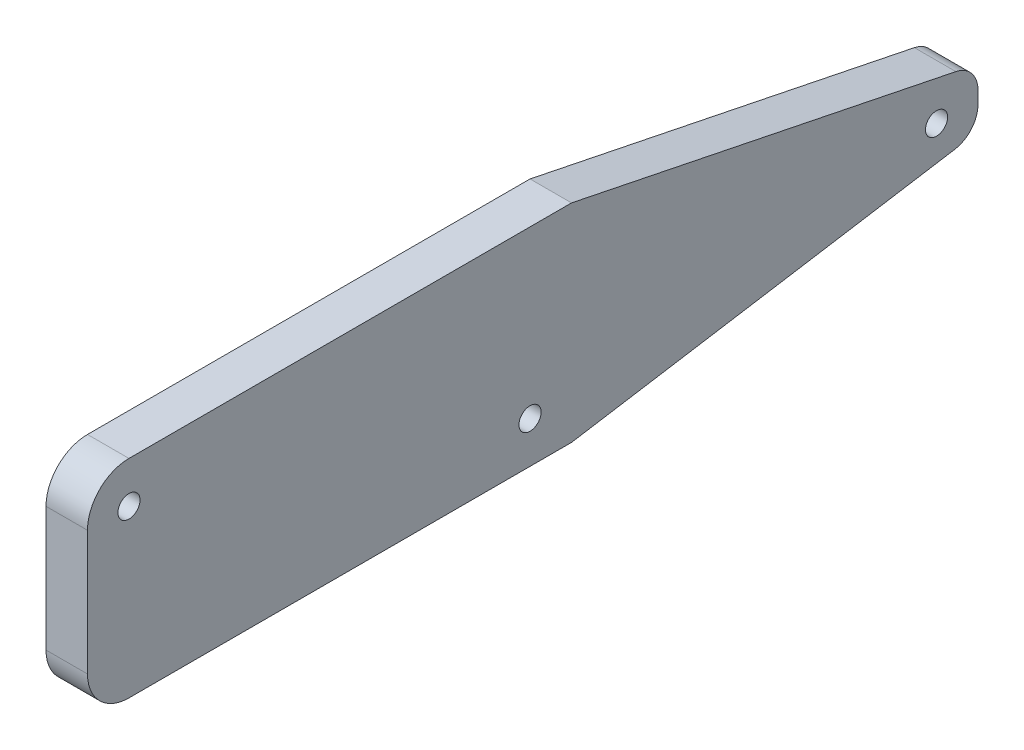
ISO-10303-21;
HEADER;
FILE_DESCRIPTION(('STEP AP214'),'2;1');
FILE_NAME('part.step','',(''),(''),'','','');
FILE_SCHEMA(('AUTOMOTIVE_DESIGN { 1 0 10303 214 1 1 1 1 }'));
ENDSEC;
DATA;
#1=APPLICATION_CONTEXT('core data for automotive mechanical design processes');
#2=APPLICATION_PROTOCOL_DEFINITION('international standard','automotive_design',2000,#1);
#3=PRODUCT_CONTEXT('',#1,'mechanical');
#4=PRODUCT('Part','Part','',(#3));
#5=PRODUCT_RELATED_PRODUCT_CATEGORY('part','',(#4));
#6=PRODUCT_DEFINITION_FORMATION('','',#4);
#7=PRODUCT_DEFINITION_CONTEXT('part definition',#1,'design');
#8=PRODUCT_DEFINITION('design','',#6,#7);
#9=PRODUCT_DEFINITION_SHAPE('','',#8);
#10=(LENGTH_UNIT() NAMED_UNIT(*) SI_UNIT(.MILLI.,.METRE.));
#11=(NAMED_UNIT(*) PLANE_ANGLE_UNIT() SI_UNIT($,.RADIAN.));
#12=(NAMED_UNIT(*) SI_UNIT($,.STERADIAN.) SOLID_ANGLE_UNIT());
#13=UNCERTAINTY_MEASURE_WITH_UNIT(LENGTH_MEASURE(1.E-05),#10,'distance_accuracy_value','');
#14=(GEOMETRIC_REPRESENTATION_CONTEXT(3) GLOBAL_UNCERTAINTY_ASSIGNED_CONTEXT((#13)) GLOBAL_UNIT_ASSIGNED_CONTEXT((#10,
#11,#12)) REPRESENTATION_CONTEXT('',''));
#15=CARTESIAN_POINT('',(0.,0.,0.));
#16=DIRECTION('',(0.,0.,1.));
#17=DIRECTION('',(1.,0.,0.));
#18=AXIS2_PLACEMENT_3D('',#15,#16,#17);
#19=CARTESIAN_POINT('',(3.,-0.13299316185545,-36.0759993740593));
#20=DIRECTION('',(1.,0.,0.));
#21=DIRECTION('',(0.,0.,-1.));
#22=AXIS2_PLACEMENT_3D('',#19,#20,#21);
#23=PLANE('',#22);
#24=CARTESIAN_POINT('',(3.,-4.49999999999999,-5.68212246066111));
#25=DIRECTION('',(1.,0.,0.));
#26=DIRECTION('',(0.,0.,-1.));
#27=AXIS2_PLACEMENT_3D('',#24,#25,#26);
#28=CIRCLE('',#27,0.8);
#29=CARTESIAN_POINT('',(3.,-4.49999999999999,-6.48212246066111));
#30=VERTEX_POINT('',#29);
#31=EDGE_CURVE('E341',#30,#30,#28,.T.);
#32=ORIENTED_EDGE('',*,*,#31,.F.);
#33=EDGE_LOOP('',(#32));
#34=FACE_BOUND('',#33,.T.);
#35=DIRECTION('',(0.,0.,1.));
#36=VECTOR('',#35,1.);
#37=CARTESIAN_POINT('',(3.,7.5,26.3178775393389));
#38=LINE('',#37,#36);
#39=CARTESIAN_POINT('',(3.,7.5,-8.68212246066111));
#40=VERTEX_POINT('',#39);
#41=CARTESIAN_POINT('',(3.,7.5,23.3178775393389));
#42=VERTEX_POINT('',#41);
#43=EDGE_CURVE('E148',#40,#42,#38,.T.);
#44=ORIENTED_EDGE('',*,*,#43,.T.);
#45=CARTESIAN_POINT('',(3.,4.5,23.3178775393389));
#46=DIRECTION('',(1.,0.,0.));
#47=DIRECTION('',(0.,0.,-1.));
#48=AXIS2_PLACEMENT_3D('',#45,#46,#47);
#49=CIRCLE('',#48,3.);
#50=CARTESIAN_POINT('',(3.,4.5,26.3178775393389));
#51=VERTEX_POINT('',#50);
#52=EDGE_CURVE('E11',#42,#51,#49,.T.);
#53=ORIENTED_EDGE('',*,*,#52,.T.);
#54=DIRECTION('',(0.,-1.,0.));
#55=VECTOR('',#54,1.);
#56=CARTESIAN_POINT('',(3.,-7.5,26.3178775393389));
#57=LINE('',#56,#55);
#58=CARTESIAN_POINT('',(3.,-4.5,26.3178775393389));
#59=VERTEX_POINT('',#58);
#60=EDGE_CURVE('E122',#51,#59,#57,.T.);
#61=ORIENTED_EDGE('',*,*,#60,.T.);
#62=CARTESIAN_POINT('',(3.,-4.5,23.3178775393389));
#63=DIRECTION('',(1.,0.,0.));
#64=DIRECTION('',(0.,0.,-1.));
#65=AXIS2_PLACEMENT_3D('',#62,#63,#64);
#66=CIRCLE('',#65,3.);
#67=CARTESIAN_POINT('',(3.,-7.5,23.3178775393389));
#68=VERTEX_POINT('',#67);
#69=EDGE_CURVE('E118',#59,#68,#66,.T.);
#70=ORIENTED_EDGE('',*,*,#69,.T.);
#71=DIRECTION('',(0.,0.,-1.));
#72=VECTOR('',#71,1.);
#73=CARTESIAN_POINT('',(3.,-7.49999999999999,-8.68212246066111));
#74=LINE('',#73,#72);
#75=CARTESIAN_POINT('',(3.,-7.49999999999999,-8.68212246066111));
#76=VERTEX_POINT('',#75);
#77=EDGE_CURVE('E111',#68,#76,#74,.T.);
#78=ORIENTED_EDGE('',*,*,#77,.T.);
#79=DIRECTION('',(0.,0.160116885510085,-0.987098061478468));
#80=VECTOR('',#79,1.);
#81=CARTESIAN_POINT('',(3.,-7.49999999999999,-8.68212246066111));
#82=LINE('',#81,#80);
#83=CARTESIAN_POINT('',(3.,-3.00450227728703,-36.3962331450794));
#84=VERTEX_POINT('',#83);
#85=EDGE_CURVE('E115',#76,#84,#82,.T.);
#86=ORIENTED_EDGE('',*,*,#85,.T.);
#87=CARTESIAN_POINT('',(3.,-1.03030615433009,-36.0759993740593));
#88=DIRECTION('',(1.,0.,0.));
#89=DIRECTION('',(0.,0.,-1.));
#90=AXIS2_PLACEMENT_3D('',#87,#88,#89);
#91=CIRCLE('',#90,2.);
#92=CARTESIAN_POINT('',(3.,-1.03030615433009,-38.0759993740593));
#93=VERTEX_POINT('',#92);
#94=EDGE_CURVE('E137',#84,#93,#91,.T.);
#95=ORIENTED_EDGE('',*,*,#94,.T.);
#96=DIRECTION('',(0.,1.,0.));
#97=VECTOR('',#96,1.);
#98=CARTESIAN_POINT('',(3.,-1.03030615433009,-38.0759993740593));
#99=LINE('',#98,#97);
#100=CARTESIAN_POINT('',(3.,-0.13299316185545,-38.0759993740593));
#101=VERTEX_POINT('',#100);
#102=EDGE_CURVE('E139',#93,#101,#99,.T.);
#103=ORIENTED_EDGE('',*,*,#102,.T.);
#104=CARTESIAN_POINT('',(3.,-0.13299316185545,-36.0759993740593));
#105=DIRECTION('',(1.,0.,0.));
#106=DIRECTION('',(0.,0.,-1.));
#107=AXIS2_PLACEMENT_3D('',#104,#105,#106);
#108=CIRCLE('',#107,2.);
#109=CARTESIAN_POINT('',(3.,1.82659863237109,-36.4759993740592));
#110=VERTEX_POINT('',#109);
#111=EDGE_CURVE('E144',#101,#110,#108,.T.);
#112=ORIENTED_EDGE('',*,*,#111,.T.);
#113=DIRECTION('',(0.,0.2,0.979795897113271));
#114=VECTOR('',#113,1.);
#115=CARTESIAN_POINT('',(3.,7.5,-8.68212246066111));
#116=LINE('',#115,#114);
#117=EDGE_CURVE('E146',#110,#40,#116,.T.);
#118=ORIENTED_EDGE('',*,*,#117,.T.);
#119=EDGE_LOOP('',(#44,#53,#61,#70,#78,#86,#95,#103,#112,#118));
#120=FACE_BOUND('',#119,.T.);
#121=CARTESIAN_POINT('',(3.,4.5,23.3178775393389));
#122=DIRECTION('',(1.,0.,0.));
#123=DIRECTION('',(0.,0.,-1.));
#124=AXIS2_PLACEMENT_3D('',#121,#122,#123);
#125=CIRCLE('',#124,0.799999999999999);
#126=CARTESIAN_POINT('',(3.,4.5,22.5178775393389));
#127=VERTEX_POINT('',#126);
#128=EDGE_CURVE('E153',#127,#127,#125,.T.);
#129=ORIENTED_EDGE('',*,*,#128,.F.);
#130=EDGE_LOOP('',(#129));
#131=FACE_BOUND('',#130,.T.);
#132=CARTESIAN_POINT('',(3.,-0.719592124937662,-35.0759993740593));
#133=DIRECTION('',(1.,0.,0.));
#134=DIRECTION('',(0.,0.,-1.));
#135=AXIS2_PLACEMENT_3D('',#132,#133,#134);
#136=CIRCLE('',#135,0.800000000000003);
#137=CARTESIAN_POINT('',(3.,-0.719592124937662,-35.8759993740593));
#138=VERTEX_POINT('',#137);
#139=EDGE_CURVE('E346',#138,#138,#136,.T.);
#140=ORIENTED_EDGE('',*,*,#139,.F.);
#141=EDGE_LOOP('',(#140));
#142=FACE_BOUND('',#141,.T.);
#143=ADVANCED_FACE('F35',(#34,#120,#131,#142),#23,.T.);
#144=CARTESIAN_POINT('',(0.,-0.13299316185545,-36.0759993740593));
#145=DIRECTION('',(1.,0.,0.));
#146=DIRECTION('',(0.,0.,-1.));
#147=AXIS2_PLACEMENT_3D('',#144,#145,#146);
#148=PLANE('',#147);
#149=DIRECTION('',(0.,-1.,0.));
#150=VECTOR('',#149,1.);
#151=CARTESIAN_POINT('',(0.,0.,26.3178775393389));
#152=LINE('',#151,#150);
#153=CARTESIAN_POINT('',(0.,4.5,26.3178775393389));
#154=VERTEX_POINT('',#153);
#155=CARTESIAN_POINT('',(0.,-4.5,26.3178775393389));
#156=VERTEX_POINT('',#155);
#157=EDGE_CURVE('E165',#154,#156,#152,.T.);
#158=ORIENTED_EDGE('',*,*,#157,.F.);
#159=CARTESIAN_POINT('',(0.,4.5,23.3178775393389));
#160=DIRECTION('',(1.,0.,0.));
#161=DIRECTION('',(0.,0.,-1.));
#162=AXIS2_PLACEMENT_3D('',#159,#160,#161);
#163=CIRCLE('',#162,3.);
#164=CARTESIAN_POINT('',(0.,7.5,23.3178775393389));
#165=VERTEX_POINT('',#164);
#166=EDGE_CURVE('E57',#154,#165,#163,.F.);
#167=ORIENTED_EDGE('',*,*,#166,.T.);
#168=DIRECTION('',(0.,0.,1.));
#169=VECTOR('',#168,1.);
#170=CARTESIAN_POINT('',(0.,7.5,26.3178775393389));
#171=LINE('',#170,#169);
#172=CARTESIAN_POINT('',(0.,7.5,-8.68212246066111));
#173=VERTEX_POINT('',#172);
#174=EDGE_CURVE('E163',#173,#165,#171,.T.);
#175=ORIENTED_EDGE('',*,*,#174,.F.);
#176=DIRECTION('',(0.,0.2,0.979795897113271));
#177=VECTOR('',#176,1.);
#178=CARTESIAN_POINT('',(0.,7.5,-8.68212246066111));
#179=LINE('',#178,#177);
#180=CARTESIAN_POINT('',(0.,1.82659863237109,-36.4759993740592));
#181=VERTEX_POINT('',#180);
#182=EDGE_CURVE('E161',#181,#173,#179,.T.);
#183=ORIENTED_EDGE('',*,*,#182,.F.);
#184=CARTESIAN_POINT('',(0.,-0.13299316185545,-36.0759993740593));
#185=DIRECTION('',(1.,0.,0.));
#186=DIRECTION('',(0.,0.,-1.));
#187=AXIS2_PLACEMENT_3D('',#184,#185,#186);
#188=CIRCLE('',#187,2.);
#189=CARTESIAN_POINT('',(0.,-0.13299316185545,-38.0759993740593));
#190=VERTEX_POINT('',#189);
#191=EDGE_CURVE('E159',#190,#181,#188,.T.);
#192=ORIENTED_EDGE('',*,*,#191,.F.);
#193=DIRECTION('',(0.,1.,0.));
#194=VECTOR('',#193,1.);
#195=CARTESIAN_POINT('',(0.,-1.03030615433009,-38.0759993740593));
#196=LINE('',#195,#194);
#197=CARTESIAN_POINT('',(0.,-1.03030615433009,-38.0759993740593));
#198=VERTEX_POINT('',#197);
#199=EDGE_CURVE('E157',#198,#190,#196,.T.);
#200=ORIENTED_EDGE('',*,*,#199,.F.);
#201=CARTESIAN_POINT('',(0.,-1.03030615433009,-36.0759993740593));
#202=DIRECTION('',(1.,0.,0.));
#203=DIRECTION('',(0.,0.,-1.));
#204=AXIS2_PLACEMENT_3D('',#201,#202,#203);
#205=CIRCLE('',#204,2.);
#206=CARTESIAN_POINT('',(0.,-3.00450227728703,-36.3962331450794));
#207=VERTEX_POINT('',#206);
#208=EDGE_CURVE('E155',#207,#198,#205,.T.);
#209=ORIENTED_EDGE('',*,*,#208,.F.);
#210=DIRECTION('',(0.,0.160116885510085,-0.987098061478468));
#211=VECTOR('',#210,1.);
#212=CARTESIAN_POINT('',(0.,-7.49999999999999,-8.68212246066111));
#213=LINE('',#212,#211);
#214=CARTESIAN_POINT('',(0.,-7.49999999999999,-8.68212246066111));
#215=VERTEX_POINT('',#214);
#216=EDGE_CURVE('E152',#215,#207,#213,.T.);
#217=ORIENTED_EDGE('',*,*,#216,.F.);
#218=DIRECTION('',(0.,0.,-1.));
#219=VECTOR('',#218,1.);
#220=CARTESIAN_POINT('',(0.,-7.49999999999999,-8.68212246066111));
#221=LINE('',#220,#219);
#222=CARTESIAN_POINT('',(0.,-7.5,23.3178775393389));
#223=VERTEX_POINT('',#222);
#224=EDGE_CURVE('E128',#223,#215,#221,.T.);
#225=ORIENTED_EDGE('',*,*,#224,.F.);
#226=CARTESIAN_POINT('',(0.,-4.5,23.3178775393389));
#227=DIRECTION('',(1.,0.,0.));
#228=DIRECTION('',(0.,0.,-1.));
#229=AXIS2_PLACEMENT_3D('',#226,#227,#228);
#230=CIRCLE('',#229,3.);
#231=EDGE_CURVE('E180',#223,#156,#230,.F.);
#232=ORIENTED_EDGE('',*,*,#231,.T.);
#233=EDGE_LOOP('',(#158,#167,#175,#183,#192,#200,#209,#217,#225,#232));
#234=FACE_BOUND('',#233,.T.);
#235=CARTESIAN_POINT('',(0.,4.5,23.3178775393389));
#236=DIRECTION('',(1.,0.,0.));
#237=DIRECTION('',(0.,0.,-1.));
#238=AXIS2_PLACEMENT_3D('',#235,#236,#237);
#239=CIRCLE('',#238,0.799999999999999);
#240=CARTESIAN_POINT('',(0.,4.5,22.5178775393389));
#241=VERTEX_POINT('',#240);
#242=EDGE_CURVE('E348',#241,#241,#239,.T.);
#243=ORIENTED_EDGE('',*,*,#242,.T.);
#244=EDGE_LOOP('',(#243));
#245=FACE_BOUND('',#244,.T.);
#246=CARTESIAN_POINT('',(0.,-4.49999999999999,-5.68212246066111));
#247=DIRECTION('',(1.,0.,0.));
#248=DIRECTION('',(0.,0.,-1.));
#249=AXIS2_PLACEMENT_3D('',#246,#247,#248);
#250=CIRCLE('',#249,0.8);
#251=CARTESIAN_POINT('',(0.,-4.49999999999999,-6.48212246066111));
#252=VERTEX_POINT('',#251);
#253=EDGE_CURVE('E344',#252,#252,#250,.T.);
#254=ORIENTED_EDGE('',*,*,#253,.T.);
#255=EDGE_LOOP('',(#254));
#256=FACE_BOUND('',#255,.T.);
#257=CARTESIAN_POINT('',(0.,-0.719592124937662,-35.0759993740593));
#258=DIRECTION('',(1.,0.,0.));
#259=DIRECTION('',(0.,0.,-1.));
#260=AXIS2_PLACEMENT_3D('',#257,#258,#259);
#261=CIRCLE('',#260,0.800000000000003);
#262=CARTESIAN_POINT('',(0.,-0.719592124937662,-35.8759993740593));
#263=VERTEX_POINT('',#262);
#264=EDGE_CURVE('E351',#263,#263,#261,.T.);
#265=ORIENTED_EDGE('',*,*,#264,.T.);
#266=EDGE_LOOP('',(#265));
#267=FACE_BOUND('',#266,.T.);
#268=ADVANCED_FACE('F196',(#234,#245,#256,#267),#148,.F.);
#269=CARTESIAN_POINT('',(3.,-7.49999999999999,-8.68212246066111));
#270=DIRECTION('',(0.,1.,0.));
#271=DIRECTION('',(0.,0.,1.));
#272=AXIS2_PLACEMENT_3D('',#269,#270,#271);
#273=PLANE('',#272);
#274=ORIENTED_EDGE('',*,*,#77,.F.);
#275=DIRECTION('',(-1.,0.,0.));
#276=VECTOR('',#275,1.);
#277=CARTESIAN_POINT('',(3.,-7.5,23.3178775393389));
#278=LINE('',#277,#276);
#279=EDGE_CURVE('E131',#68,#223,#278,.T.);
#280=ORIENTED_EDGE('',*,*,#279,.T.);
#281=ORIENTED_EDGE('',*,*,#224,.T.);
#282=DIRECTION('',(-1.,0.,0.));
#283=VECTOR('',#282,1.);
#284=CARTESIAN_POINT('',(3.,-7.49999999999999,-8.68212246066111));
#285=LINE('',#284,#283);
#286=EDGE_CURVE('E125',#76,#215,#285,.T.);
#287=ORIENTED_EDGE('',*,*,#286,.F.);
#288=EDGE_LOOP('',(#274,#280,#281,#287));
#289=FACE_BOUND('',#288,.T.);
#290=ADVANCED_FACE('F126',(#289),#273,.F.);
#291=CARTESIAN_POINT('',(3.,-7.49999999999999,-8.68212246066111));
#292=DIRECTION('',(0.,0.987098061478468,0.160116885510085));
#293=DIRECTION('',(0.,-0.160116885510085,0.987098061478469));
#294=AXIS2_PLACEMENT_3D('',#291,#292,#293);
#295=PLANE('',#294);
#296=ORIENTED_EDGE('',*,*,#216,.T.);
#297=DIRECTION('',(-1.,0.,0.));
#298=VECTOR('',#297,1.);
#299=CARTESIAN_POINT('',(3.,-3.00450227728703,-36.3962331450794));
#300=LINE('',#299,#298);
#301=EDGE_CURVE('E132',#84,#207,#300,.T.);
#302=ORIENTED_EDGE('',*,*,#301,.F.);
#303=ORIENTED_EDGE('',*,*,#85,.F.);
#304=ORIENTED_EDGE('',*,*,#286,.T.);
#305=EDGE_LOOP('',(#296,#302,#303,#304));
#306=FACE_BOUND('',#305,.T.);
#307=ADVANCED_FACE('F134',(#306),#295,.F.);
#308=CARTESIAN_POINT('',(3.,-1.03030615433009,-36.0759993740593));
#309=DIRECTION('',(-1.,0.,0.));
#310=DIRECTION('',(0.,0.,1.));
#311=AXIS2_PLACEMENT_3D('',#308,#309,#310);
#312=CYLINDRICAL_SURFACE('',#311,2.);
#313=ORIENTED_EDGE('',*,*,#208,.T.);
#314=DIRECTION('',(-1.,0.,0.));
#315=VECTOR('',#314,1.);
#316=CARTESIAN_POINT('',(3.,-1.03030615433009,-38.0759993740593));
#317=LINE('',#316,#315);
#318=EDGE_CURVE('E175',#93,#198,#317,.T.);
#319=ORIENTED_EDGE('',*,*,#318,.F.);
#320=ORIENTED_EDGE('',*,*,#94,.F.);
#321=ORIENTED_EDGE('',*,*,#301,.T.);
#322=EDGE_LOOP('',(#313,#319,#320,#321));
#323=FACE_BOUND('',#322,.T.);
#324=ADVANCED_FACE('F239',(#323),#312,.T.);
#325=CARTESIAN_POINT('',(3.,-1.03030615433009,-38.0759993740593));
#326=DIRECTION('',(0.,0.,1.));
#327=DIRECTION('',(0.,-1.,0.));
#328=AXIS2_PLACEMENT_3D('',#325,#326,#327);
#329=PLANE('',#328);
#330=ORIENTED_EDGE('',*,*,#199,.T.);
#331=DIRECTION('',(-1.,0.,0.));
#332=VECTOR('',#331,1.);
#333=CARTESIAN_POINT('',(3.,-0.13299316185545,-38.0759993740593));
#334=LINE('',#333,#332);
#335=EDGE_CURVE('E172',#101,#190,#334,.T.);
#336=ORIENTED_EDGE('',*,*,#335,.F.);
#337=ORIENTED_EDGE('',*,*,#102,.F.);
#338=ORIENTED_EDGE('',*,*,#318,.T.);
#339=EDGE_LOOP('',(#330,#336,#337,#338));
#340=FACE_BOUND('',#339,.T.);
#341=ADVANCED_FACE('F235',(#340),#329,.F.);
#342=CARTESIAN_POINT('',(3.,-0.13299316185545,-36.0759993740593));
#343=DIRECTION('',(-1.,0.,0.));
#344=DIRECTION('',(0.,0.,1.));
#345=AXIS2_PLACEMENT_3D('',#342,#343,#344);
#346=CYLINDRICAL_SURFACE('',#345,2.);
#347=ORIENTED_EDGE('',*,*,#191,.T.);
#348=DIRECTION('',(-1.,0.,0.));
#349=VECTOR('',#348,1.);
#350=CARTESIAN_POINT('',(3.,1.82659863237109,-36.4759993740592));
#351=LINE('',#350,#349);
#352=EDGE_CURVE('E169',#110,#181,#351,.T.);
#353=ORIENTED_EDGE('',*,*,#352,.F.);
#354=ORIENTED_EDGE('',*,*,#111,.F.);
#355=ORIENTED_EDGE('',*,*,#335,.T.);
#356=EDGE_LOOP('',(#347,#353,#354,#355));
#357=FACE_BOUND('',#356,.T.);
#358=ADVANCED_FACE('F231',(#357),#346,.T.);
#359=CARTESIAN_POINT('',(3.,7.5,-8.68212246066111));
#360=DIRECTION('',(0.,-0.979795897113271,0.2));
#361=DIRECTION('',(0.,-0.2,-0.979795897113271));
#362=AXIS2_PLACEMENT_3D('',#359,#360,#361);
#363=PLANE('',#362);
#364=ORIENTED_EDGE('',*,*,#182,.T.);
#365=DIRECTION('',(-1.,0.,0.));
#366=VECTOR('',#365,1.);
#367=CARTESIAN_POINT('',(3.,7.5,-8.68212246066111));
#368=LINE('',#367,#366);
#369=EDGE_CURVE('E150',#40,#173,#368,.T.);
#370=ORIENTED_EDGE('',*,*,#369,.F.);
#371=ORIENTED_EDGE('',*,*,#117,.F.);
#372=ORIENTED_EDGE('',*,*,#352,.T.);
#373=EDGE_LOOP('',(#364,#370,#371,#372));
#374=FACE_BOUND('',#373,.T.);
#375=ADVANCED_FACE('F228',(#374),#363,.F.);
#376=CARTESIAN_POINT('',(3.,7.5,26.3178775393389));
#377=DIRECTION('',(0.,-1.,0.));
#378=DIRECTION('',(0.,0.,-1.));
#379=AXIS2_PLACEMENT_3D('',#376,#377,#378);
#380=PLANE('',#379);
#381=ORIENTED_EDGE('',*,*,#174,.T.);
#382=DIRECTION('',(-1.,0.,0.));
#383=VECTOR('',#382,1.);
#384=CARTESIAN_POINT('',(3.,7.5,23.3178775393389));
#385=LINE('',#384,#383);
#386=EDGE_CURVE('E43',#165,#42,#385,.F.);
#387=ORIENTED_EDGE('',*,*,#386,.T.);
#388=ORIENTED_EDGE('',*,*,#43,.F.);
#389=ORIENTED_EDGE('',*,*,#369,.T.);
#390=EDGE_LOOP('',(#381,#387,#388,#389));
#391=FACE_BOUND('',#390,.T.);
#392=ADVANCED_FACE('F225',(#391),#380,.F.);
#393=CARTESIAN_POINT('',(3.,0.,26.3178775393389));
#394=DIRECTION('',(0.,0.,-1.));
#395=DIRECTION('',(-1.,0.,0.));
#396=AXIS2_PLACEMENT_3D('',#393,#394,#395);
#397=PLANE('',#396);
#398=ORIENTED_EDGE('',*,*,#60,.F.);
#399=DIRECTION('',(-1.,0.,0.));
#400=VECTOR('',#399,1.);
#401=CARTESIAN_POINT('',(3.,4.5,26.3178775393389));
#402=LINE('',#401,#400);
#403=EDGE_CURVE('E187',#51,#154,#402,.T.);
#404=ORIENTED_EDGE('',*,*,#403,.T.);
#405=ORIENTED_EDGE('',*,*,#157,.T.);
#406=DIRECTION('',(-1.,0.,0.));
#407=VECTOR('',#406,1.);
#408=CARTESIAN_POINT('',(3.,-4.5,26.3178775393389));
#409=LINE('',#408,#407);
#410=EDGE_CURVE('E183',#156,#59,#409,.F.);
#411=ORIENTED_EDGE('',*,*,#410,.T.);
#412=EDGE_LOOP('',(#398,#404,#405,#411));
#413=FACE_BOUND('',#412,.T.);
#414=ADVANCED_FACE('F193',(#413),#397,.F.);
#415=CARTESIAN_POINT('',(3.,4.5,23.3178775393389));
#416=DIRECTION('',(-1.,0.,0.));
#417=DIRECTION('',(0.,0.,1.));
#418=AXIS2_PLACEMENT_3D('',#415,#416,#417);
#419=CYLINDRICAL_SURFACE('',#418,0.799999999999999);
#420=ORIENTED_EDGE('',*,*,#128,.T.);
#421=EDGE_LOOP('',(#420));
#422=FACE_BOUND('',#421,.T.);
#423=ORIENTED_EDGE('',*,*,#242,.F.);
#424=EDGE_LOOP('',(#423));
#425=FACE_BOUND('',#424,.T.);
#426=ADVANCED_FACE('F220',(#422,#425),#419,.F.);
#427=CARTESIAN_POINT('',(3.,-4.49999999999999,-5.68212246066111));
#428=DIRECTION('',(-1.,0.,0.));
#429=DIRECTION('',(0.,0.,1.));
#430=AXIS2_PLACEMENT_3D('',#427,#428,#429);
#431=CYLINDRICAL_SURFACE('',#430,0.8);
#432=ORIENTED_EDGE('',*,*,#31,.T.);
#433=EDGE_LOOP('',(#432));
#434=FACE_BOUND('',#433,.T.);
#435=ORIENTED_EDGE('',*,*,#253,.F.);
#436=EDGE_LOOP('',(#435));
#437=FACE_BOUND('',#436,.T.);
#438=ADVANCED_FACE('F207',(#434,#437),#431,.F.);
#439=CARTESIAN_POINT('',(3.,-0.719592124937662,-35.0759993740593));
#440=DIRECTION('',(-1.,0.,0.));
#441=DIRECTION('',(0.,0.,1.));
#442=AXIS2_PLACEMENT_3D('',#439,#440,#441);
#443=CYLINDRICAL_SURFACE('',#442,0.800000000000003);
#444=ORIENTED_EDGE('',*,*,#139,.T.);
#445=EDGE_LOOP('',(#444));
#446=FACE_BOUND('',#445,.T.);
#447=ORIENTED_EDGE('',*,*,#264,.F.);
#448=EDGE_LOOP('',(#447));
#449=FACE_BOUND('',#448,.T.);
#450=ADVANCED_FACE('F202',(#446,#449),#443,.F.);
#451=CARTESIAN_POINT('',(3.,-4.5,23.3178775393389));
#452=DIRECTION('',(-1.,0.,0.));
#453=DIRECTION('',(0.,0.,1.));
#454=AXIS2_PLACEMENT_3D('',#451,#452,#453);
#455=CYLINDRICAL_SURFACE('',#454,3.);
#456=ORIENTED_EDGE('',*,*,#69,.F.);
#457=ORIENTED_EDGE('',*,*,#410,.F.);
#458=ORIENTED_EDGE('',*,*,#231,.F.);
#459=ORIENTED_EDGE('',*,*,#279,.F.);
#460=EDGE_LOOP('',(#456,#457,#458,#459));
#461=FACE_BOUND('',#460,.T.);
#462=ADVANCED_FACE('F200',(#461),#455,.T.);
#463=CARTESIAN_POINT('',(3.,4.5,23.3178775393389));
#464=DIRECTION('',(-1.,0.,0.));
#465=DIRECTION('',(0.,0.,1.));
#466=AXIS2_PLACEMENT_3D('',#463,#464,#465);
#467=CYLINDRICAL_SURFACE('',#466,3.);
#468=ORIENTED_EDGE('',*,*,#52,.F.);
#469=ORIENTED_EDGE('',*,*,#386,.F.);
#470=ORIENTED_EDGE('',*,*,#166,.F.);
#471=ORIENTED_EDGE('',*,*,#403,.F.);
#472=EDGE_LOOP('',(#468,#469,#470,#471));
#473=FACE_BOUND('',#472,.T.);
#474=ADVANCED_FACE('F37',(#473),#467,.T.);
#475=CLOSED_SHELL('',(#143,#268,#290,#307,#324,#341,#358,#375,#392,#414,#426,#438,#450,#462,#474));
#476=MANIFOLD_SOLID_BREP('B2',#475);
#477=ADVANCED_BREP_SHAPE_REPRESENTATION('',(#18,#476),#14);
#478=SHAPE_DEFINITION_REPRESENTATION(#9,#477);
ENDSEC;
END-ISO-10303-21;
